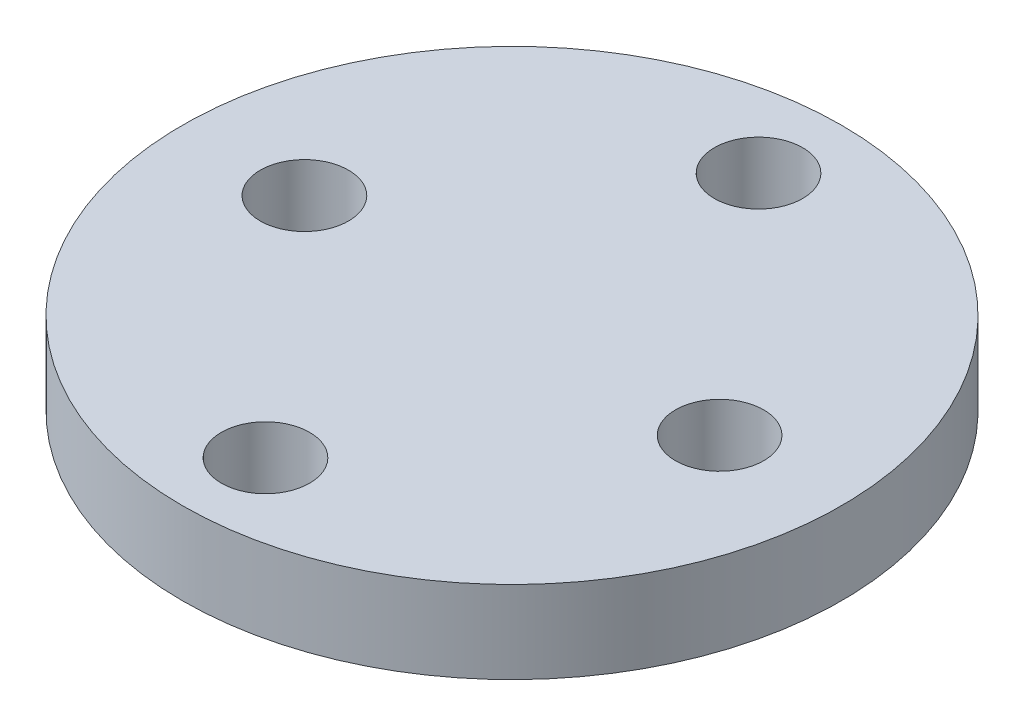
ISO-10303-21;
HEADER;
FILE_DESCRIPTION(('STEP AP214'),'2;1');
FILE_NAME('part.step','',(''),(''),'','','');
FILE_SCHEMA(('AUTOMOTIVE_DESIGN { 1 0 10303 214 1 1 1 1 }'));
ENDSEC;
DATA;
#1=APPLICATION_CONTEXT('core data for automotive mechanical design processes');
#2=APPLICATION_PROTOCOL_DEFINITION('international standard','automotive_design',2000,#1);
#3=PRODUCT_CONTEXT('',#1,'mechanical');
#4=PRODUCT('Part','Part','',(#3));
#5=PRODUCT_RELATED_PRODUCT_CATEGORY('part','',(#4));
#6=PRODUCT_DEFINITION_FORMATION('','',#4);
#7=PRODUCT_DEFINITION_CONTEXT('part definition',#1,'design');
#8=PRODUCT_DEFINITION('design','',#6,#7);
#9=PRODUCT_DEFINITION_SHAPE('','',#8);
#10=(LENGTH_UNIT() NAMED_UNIT(*) SI_UNIT(.MILLI.,.METRE.));
#11=(NAMED_UNIT(*) PLANE_ANGLE_UNIT() SI_UNIT($,.RADIAN.));
#12=(NAMED_UNIT(*) SI_UNIT($,.STERADIAN.) SOLID_ANGLE_UNIT());
#13=UNCERTAINTY_MEASURE_WITH_UNIT(LENGTH_MEASURE(1.E-05),#10,'distance_accuracy_value','');
#14=(GEOMETRIC_REPRESENTATION_CONTEXT(3) GLOBAL_UNCERTAINTY_ASSIGNED_CONTEXT((#13)) GLOBAL_UNIT_ASSIGNED_CONTEXT((#10,
#11,#12)) REPRESENTATION_CONTEXT('',''));
#15=CARTESIAN_POINT('',(0.,0.,0.));
#16=DIRECTION('',(0.,0.,1.));
#17=DIRECTION('',(1.,0.,0.));
#18=AXIS2_PLACEMENT_3D('',#15,#16,#17);
#19=CARTESIAN_POINT('',(0.,3.175,0.));
#20=DIRECTION('',(0.,1.,0.));
#21=DIRECTION('',(0.,0.,1.));
#22=AXIS2_PLACEMENT_3D('',#19,#20,#21);
#23=PLANE('',#22);
#24=CARTESIAN_POINT('',(0.,3.175,9.5));
#25=DIRECTION('',(0.,1.,0.));
#26=DIRECTION('',(0.,0.,1.));
#27=AXIS2_PLACEMENT_3D('',#24,#25,#26);
#28=CIRCLE('',#27,1.7);
#29=CARTESIAN_POINT('',(0.,3.175,11.2));
#30=VERTEX_POINT('',#29);
#31=EDGE_CURVE('E68',#30,#30,#28,.T.);
#32=ORIENTED_EDGE('',*,*,#31,.F.);
#33=EDGE_LOOP('',(#32));
#34=FACE_BOUND('',#33,.T.);
#35=CARTESIAN_POINT('',(0.,3.175,-9.5));
#36=DIRECTION('',(0.,1.,0.));
#37=DIRECTION('',(0.,0.,1.));
#38=AXIS2_PLACEMENT_3D('',#35,#36,#37);
#39=CIRCLE('',#38,1.7);
#40=CARTESIAN_POINT('',(0.,3.175,-7.8));
#41=VERTEX_POINT('',#40);
#42=EDGE_CURVE('E54',#41,#41,#39,.T.);
#43=ORIENTED_EDGE('',*,*,#42,.F.);
#44=EDGE_LOOP('',(#43));
#45=FACE_BOUND('',#44,.T.);
#46=CARTESIAN_POINT('',(0.,3.175,0.));
#47=DIRECTION('',(0.,1.,0.));
#48=DIRECTION('',(0.,0.,1.));
#49=AXIS2_PLACEMENT_3D('',#46,#47,#48);
#50=CIRCLE('',#49,12.7);
#51=CARTESIAN_POINT('',(0.,3.175,12.7));
#52=VERTEX_POINT('',#51);
#53=EDGE_CURVE('E10',#52,#52,#50,.T.);
#54=ORIENTED_EDGE('',*,*,#53,.T.);
#55=EDGE_LOOP('',(#54));
#56=FACE_BOUND('',#55,.T.);
#57=CARTESIAN_POINT('',(-8.,3.175,0.));
#58=DIRECTION('',(0.,1.,0.));
#59=DIRECTION('',(0.,0.,1.));
#60=AXIS2_PLACEMENT_3D('',#57,#58,#59);
#61=CIRCLE('',#60,1.7);
#62=CARTESIAN_POINT('',(-8.,3.175,1.7));
#63=VERTEX_POINT('',#62);
#64=EDGE_CURVE('E60',#63,#63,#61,.T.);
#65=ORIENTED_EDGE('',*,*,#64,.F.);
#66=EDGE_LOOP('',(#65));
#67=FACE_BOUND('',#66,.T.);
#68=CARTESIAN_POINT('',(8.,3.175,0.));
#69=DIRECTION('',(0.,1.,0.));
#70=DIRECTION('',(0.,0.,1.));
#71=AXIS2_PLACEMENT_3D('',#68,#69,#70);
#72=CIRCLE('',#71,1.7);
#73=CARTESIAN_POINT('',(8.,3.175,1.70000000000006));
#74=VERTEX_POINT('',#73);
#75=EDGE_CURVE('E76',#74,#74,#72,.T.);
#76=ORIENTED_EDGE('',*,*,#75,.F.);
#77=EDGE_LOOP('',(#76));
#78=FACE_BOUND('',#77,.T.);
#79=ADVANCED_FACE('F41',(#34,#45,#56,#67,#78),#23,.T.);
#80=CARTESIAN_POINT('',(0.,0.,0.));
#81=DIRECTION('',(0.,1.,0.));
#82=DIRECTION('',(0.,0.,1.));
#83=AXIS2_PLACEMENT_3D('',#80,#81,#82);
#84=PLANE('',#83);
#85=CARTESIAN_POINT('',(0.,0.,0.));
#86=DIRECTION('',(0.,1.,0.));
#87=DIRECTION('',(0.,0.,1.));
#88=AXIS2_PLACEMENT_3D('',#85,#86,#87);
#89=CIRCLE('',#88,12.7);
#90=CARTESIAN_POINT('',(0.,0.,12.7));
#91=VERTEX_POINT('',#90);
#92=EDGE_CURVE('E45',#91,#91,#89,.T.);
#93=ORIENTED_EDGE('',*,*,#92,.F.);
#94=EDGE_LOOP('',(#93));
#95=FACE_BOUND('',#94,.T.);
#96=CARTESIAN_POINT('',(0.,0.,-9.5));
#97=DIRECTION('',(0.,1.,0.));
#98=DIRECTION('',(0.,0.,1.));
#99=AXIS2_PLACEMENT_3D('',#96,#97,#98);
#100=CIRCLE('',#99,1.7);
#101=CARTESIAN_POINT('',(0.,0.,-7.8));
#102=VERTEX_POINT('',#101);
#103=EDGE_CURVE('E56',#102,#102,#100,.T.);
#104=ORIENTED_EDGE('',*,*,#103,.T.);
#105=EDGE_LOOP('',(#104));
#106=FACE_BOUND('',#105,.T.);
#107=CARTESIAN_POINT('',(-8.,0.,0.));
#108=DIRECTION('',(0.,1.,0.));
#109=DIRECTION('',(0.,0.,1.));
#110=AXIS2_PLACEMENT_3D('',#107,#108,#109);
#111=CIRCLE('',#110,1.7);
#112=CARTESIAN_POINT('',(-8.,0.,1.7));
#113=VERTEX_POINT('',#112);
#114=EDGE_CURVE('E64',#113,#113,#111,.T.);
#115=ORIENTED_EDGE('',*,*,#114,.T.);
#116=EDGE_LOOP('',(#115));
#117=FACE_BOUND('',#116,.T.);
#118=CARTESIAN_POINT('',(0.,0.,9.5));
#119=DIRECTION('',(0.,1.,0.));
#120=DIRECTION('',(0.,0.,1.));
#121=AXIS2_PLACEMENT_3D('',#118,#119,#120);
#122=CIRCLE('',#121,1.7);
#123=CARTESIAN_POINT('',(0.,0.,11.2));
#124=VERTEX_POINT('',#123);
#125=EDGE_CURVE('E72',#124,#124,#122,.T.);
#126=ORIENTED_EDGE('',*,*,#125,.T.);
#127=EDGE_LOOP('',(#126));
#128=FACE_BOUND('',#127,.T.);
#129=CARTESIAN_POINT('',(8.,0.,0.));
#130=DIRECTION('',(0.,1.,0.));
#131=DIRECTION('',(0.,0.,1.));
#132=AXIS2_PLACEMENT_3D('',#129,#130,#131);
#133=CIRCLE('',#132,1.7);
#134=CARTESIAN_POINT('',(8.,0.,1.70000000000006));
#135=VERTEX_POINT('',#134);
#136=EDGE_CURVE('E80',#135,#135,#133,.T.);
#137=ORIENTED_EDGE('',*,*,#136,.T.);
#138=EDGE_LOOP('',(#137));
#139=FACE_BOUND('',#138,.T.);
#140=ADVANCED_FACE('F92',(#95,#106,#117,#128,#139),#84,.F.);
#141=CARTESIAN_POINT('',(0.,3.175,0.));
#142=DIRECTION('',(0.,-1.,0.));
#143=DIRECTION('',(0.,0.,-1.));
#144=AXIS2_PLACEMENT_3D('',#141,#142,#143);
#145=CYLINDRICAL_SURFACE('',#144,12.7);
#146=ORIENTED_EDGE('',*,*,#53,.F.);
#147=EDGE_LOOP('',(#146));
#148=FACE_BOUND('',#147,.T.);
#149=ORIENTED_EDGE('',*,*,#92,.T.);
#150=EDGE_LOOP('',(#149));
#151=FACE_BOUND('',#150,.T.);
#152=ADVANCED_FACE('F43',(#148,#151),#145,.T.);
#153=CARTESIAN_POINT('',(0.,3.175,-9.5));
#154=DIRECTION('',(0.,-1.,0.));
#155=DIRECTION('',(0.,0.,-1.));
#156=AXIS2_PLACEMENT_3D('',#153,#154,#155);
#157=CYLINDRICAL_SURFACE('',#156,1.7);
#158=ORIENTED_EDGE('',*,*,#42,.T.);
#159=EDGE_LOOP('',(#158));
#160=FACE_BOUND('',#159,.T.);
#161=ORIENTED_EDGE('',*,*,#103,.F.);
#162=EDGE_LOOP('',(#161));
#163=FACE_BOUND('',#162,.T.);
#164=ADVANCED_FACE('F102',(#160,#163),#157,.F.);
#165=CARTESIAN_POINT('',(-8.,3.175,0.));
#166=DIRECTION('',(0.,-1.,0.));
#167=DIRECTION('',(0.,0.,-1.));
#168=AXIS2_PLACEMENT_3D('',#165,#166,#167);
#169=CYLINDRICAL_SURFACE('',#168,1.7);
#170=ORIENTED_EDGE('',*,*,#64,.T.);
#171=EDGE_LOOP('',(#170));
#172=FACE_BOUND('',#171,.T.);
#173=ORIENTED_EDGE('',*,*,#114,.F.);
#174=EDGE_LOOP('',(#173));
#175=FACE_BOUND('',#174,.T.);
#176=ADVANCED_FACE('F105',(#172,#175),#169,.F.);
#177=CARTESIAN_POINT('',(0.,3.175,9.5));
#178=DIRECTION('',(0.,-1.,0.));
#179=DIRECTION('',(0.,0.,-1.));
#180=AXIS2_PLACEMENT_3D('',#177,#178,#179);
#181=CYLINDRICAL_SURFACE('',#180,1.7);
#182=ORIENTED_EDGE('',*,*,#31,.T.);
#183=EDGE_LOOP('',(#182));
#184=FACE_BOUND('',#183,.T.);
#185=ORIENTED_EDGE('',*,*,#125,.F.);
#186=EDGE_LOOP('',(#185));
#187=FACE_BOUND('',#186,.T.);
#188=ADVANCED_FACE('F109',(#184,#187),#181,.F.);
#189=CARTESIAN_POINT('',(8.,3.175,0.));
#190=DIRECTION('',(0.,-1.,0.));
#191=DIRECTION('',(0.,0.,-1.));
#192=AXIS2_PLACEMENT_3D('',#189,#190,#191);
#193=CYLINDRICAL_SURFACE('',#192,1.7);
#194=ORIENTED_EDGE('',*,*,#75,.T.);
#195=EDGE_LOOP('',(#194));
#196=FACE_BOUND('',#195,.T.);
#197=ORIENTED_EDGE('',*,*,#136,.F.);
#198=EDGE_LOOP('',(#197));
#199=FACE_BOUND('',#198,.T.);
#200=ADVANCED_FACE('F88',(#196,#199),#193,.F.);
#201=CLOSED_SHELL('',(#79,#140,#152,#164,#176,#188,#200));
#202=MANIFOLD_SOLID_BREP('B2',#201);
#203=ADVANCED_BREP_SHAPE_REPRESENTATION('',(#18,#202),#14);
#204=SHAPE_DEFINITION_REPRESENTATION(#9,#203);
ENDSEC;
END-ISO-10303-21;
